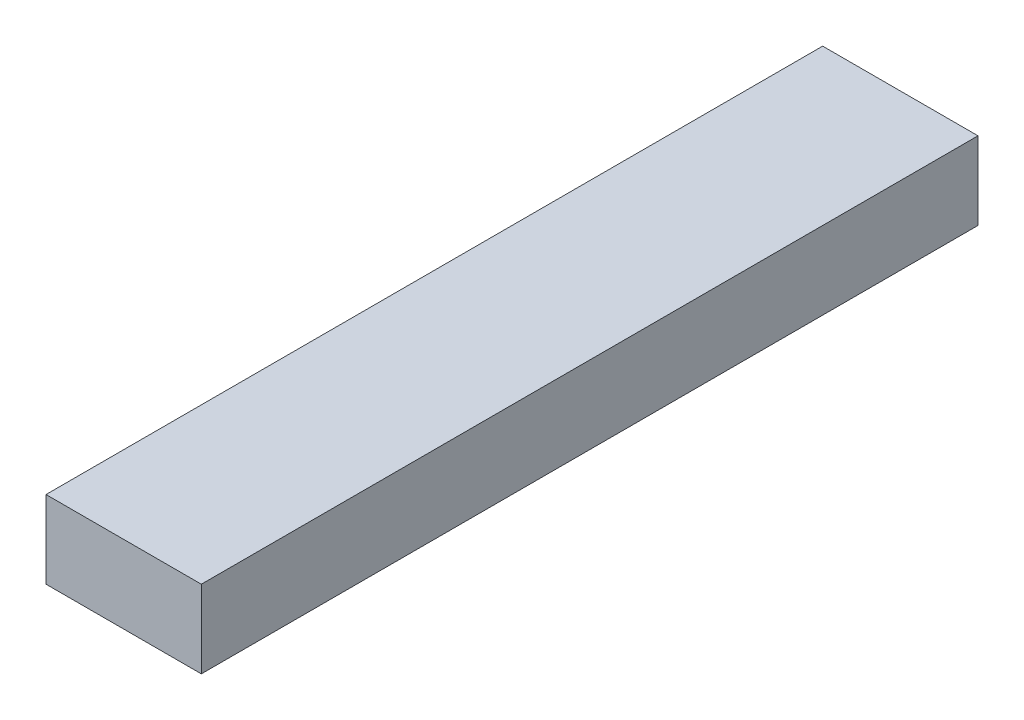
ISO-10303-21;
HEADER;
FILE_DESCRIPTION(('STEP AP214'),'2;1');
FILE_NAME('part.step','',(''),(''),'','','');
FILE_SCHEMA(('AUTOMOTIVE_DESIGN { 1 0 10303 214 1 1 1 1 }'));
ENDSEC;
DATA;
#1=APPLICATION_CONTEXT('core data for automotive mechanical design processes');
#2=APPLICATION_PROTOCOL_DEFINITION('international standard','automotive_design',2000,#1);
#3=PRODUCT_CONTEXT('',#1,'mechanical');
#4=PRODUCT('Part','Part','',(#3));
#5=PRODUCT_RELATED_PRODUCT_CATEGORY('part','',(#4));
#6=PRODUCT_DEFINITION_FORMATION('','',#4);
#7=PRODUCT_DEFINITION_CONTEXT('part definition',#1,'design');
#8=PRODUCT_DEFINITION('design','',#6,#7);
#9=PRODUCT_DEFINITION_SHAPE('','',#8);
#10=(LENGTH_UNIT() NAMED_UNIT(*) SI_UNIT(.MILLI.,.METRE.));
#11=(NAMED_UNIT(*) PLANE_ANGLE_UNIT() SI_UNIT($,.RADIAN.));
#12=(NAMED_UNIT(*) SI_UNIT($,.STERADIAN.) SOLID_ANGLE_UNIT());
#13=UNCERTAINTY_MEASURE_WITH_UNIT(LENGTH_MEASURE(1.E-05),#10,'distance_accuracy_value','');
#14=(GEOMETRIC_REPRESENTATION_CONTEXT(3) GLOBAL_UNCERTAINTY_ASSIGNED_CONTEXT((#13)) GLOBAL_UNIT_ASSIGNED_CONTEXT((#10,
#11,#12)) REPRESENTATION_CONTEXT('',''));
#15=CARTESIAN_POINT('',(0.,0.,0.));
#16=DIRECTION('',(0.,0.,1.));
#17=DIRECTION('',(1.,0.,0.));
#18=AXIS2_PLACEMENT_3D('',#15,#16,#17);
#19=CARTESIAN_POINT('',(-9.99999999999998,10.,-50.));
#20=DIRECTION('',(1.,0.,0.));
#21=DIRECTION('',(0.,0.,-1.));
#22=AXIS2_PLACEMENT_3D('',#19,#20,#21);
#23=PLANE('',#22);
#24=DIRECTION('',(0.,0.,1.));
#25=VECTOR('',#24,1.);
#26=CARTESIAN_POINT('',(-9.99999999999998,0.,-50.));
#27=LINE('',#26,#25);
#28=CARTESIAN_POINT('',(-9.99999999999998,0.,-50.));
#29=VERTEX_POINT('',#28);
#30=CARTESIAN_POINT('',(-9.99999999999995,0.,50.));
#31=VERTEX_POINT('',#30);
#32=EDGE_CURVE('E96',#29,#31,#27,.T.);
#33=ORIENTED_EDGE('',*,*,#32,.T.);
#34=DIRECTION('',(0.,-1.,0.));
#35=VECTOR('',#34,1.);
#36=CARTESIAN_POINT('',(-9.99999999999995,10.,50.));
#37=LINE('',#36,#35);
#38=CARTESIAN_POINT('',(-9.99999999999995,10.,50.));
#39=VERTEX_POINT('',#38);
#40=EDGE_CURVE('E11',#39,#31,#37,.T.);
#41=ORIENTED_EDGE('',*,*,#40,.F.);
#42=DIRECTION('',(0.,0.,1.));
#43=VECTOR('',#42,1.);
#44=CARTESIAN_POINT('',(-9.99999999999998,10.,-50.));
#45=LINE('',#44,#43);
#46=CARTESIAN_POINT('',(-9.99999999999998,10.,-50.));
#47=VERTEX_POINT('',#46);
#48=EDGE_CURVE('E84',#47,#39,#45,.T.);
#49=ORIENTED_EDGE('',*,*,#48,.F.);
#50=DIRECTION('',(0.,-1.,0.));
#51=VECTOR('',#50,1.);
#52=CARTESIAN_POINT('',(-9.99999999999998,10.,-50.));
#53=LINE('',#52,#51);
#54=EDGE_CURVE('E92',#47,#29,#53,.T.);
#55=ORIENTED_EDGE('',*,*,#54,.T.);
#56=EDGE_LOOP('',(#33,#41,#49,#55));
#57=FACE_BOUND('',#56,.T.);
#58=ADVANCED_FACE('F33',(#57),#23,.F.);
#59=CARTESIAN_POINT('',(-9.99999999999995,10.,50.));
#60=DIRECTION('',(0.,0.,-1.));
#61=DIRECTION('',(-1.,0.,0.));
#62=AXIS2_PLACEMENT_3D('',#59,#60,#61);
#63=PLANE('',#62);
#64=DIRECTION('',(1.,0.,0.));
#65=VECTOR('',#64,1.);
#66=CARTESIAN_POINT('',(-9.99999999999995,0.,50.));
#67=LINE('',#66,#65);
#68=CARTESIAN_POINT('',(10.,0.,50.));
#69=VERTEX_POINT('',#68);
#70=EDGE_CURVE('E88',#31,#69,#67,.T.);
#71=ORIENTED_EDGE('',*,*,#70,.T.);
#72=DIRECTION('',(0.,-1.,0.));
#73=VECTOR('',#72,1.);
#74=CARTESIAN_POINT('',(10.,10.,50.));
#75=LINE('',#74,#73);
#76=CARTESIAN_POINT('',(10.,10.,50.));
#77=VERTEX_POINT('',#76);
#78=EDGE_CURVE('E41',#77,#69,#75,.T.);
#79=ORIENTED_EDGE('',*,*,#78,.F.);
#80=DIRECTION('',(1.,0.,0.));
#81=VECTOR('',#80,1.);
#82=CARTESIAN_POINT('',(-9.99999999999995,10.,50.));
#83=LINE('',#82,#81);
#84=EDGE_CURVE('E79',#39,#77,#83,.T.);
#85=ORIENTED_EDGE('',*,*,#84,.F.);
#86=ORIENTED_EDGE('',*,*,#40,.T.);
#87=EDGE_LOOP('',(#71,#79,#85,#86));
#88=FACE_BOUND('',#87,.T.);
#89=ADVANCED_FACE('F87',(#88),#63,.F.);
#90=CARTESIAN_POINT('',(9.99999999999998,10.,-50.));
#91=DIRECTION('',(-1.,0.,0.));
#92=DIRECTION('',(0.,0.,1.));
#93=AXIS2_PLACEMENT_3D('',#90,#91,#92);
#94=PLANE('',#93);
#95=DIRECTION('',(0.,0.,-1.));
#96=VECTOR('',#95,1.);
#97=CARTESIAN_POINT('',(9.99999999999998,0.,-50.));
#98=LINE('',#97,#96);
#99=CARTESIAN_POINT('',(9.99999999999998,0.,-50.));
#100=VERTEX_POINT('',#99);
#101=EDGE_CURVE('E66',#69,#100,#98,.T.);
#102=ORIENTED_EDGE('',*,*,#101,.T.);
#103=DIRECTION('',(0.,-1.,0.));
#104=VECTOR('',#103,1.);
#105=CARTESIAN_POINT('',(9.99999999999998,10.,-50.));
#106=LINE('',#105,#104);
#107=CARTESIAN_POINT('',(9.99999999999998,10.,-50.));
#108=VERTEX_POINT('',#107);
#109=EDGE_CURVE('E89',#108,#100,#106,.T.);
#110=ORIENTED_EDGE('',*,*,#109,.F.);
#111=DIRECTION('',(0.,0.,-1.));
#112=VECTOR('',#111,1.);
#113=CARTESIAN_POINT('',(9.99999999999998,10.,-50.));
#114=LINE('',#113,#112);
#115=EDGE_CURVE('E82',#77,#108,#114,.T.);
#116=ORIENTED_EDGE('',*,*,#115,.F.);
#117=ORIENTED_EDGE('',*,*,#78,.T.);
#118=EDGE_LOOP('',(#102,#110,#116,#117));
#119=FACE_BOUND('',#118,.T.);
#120=ADVANCED_FACE('F90',(#119),#94,.F.);
#121=CARTESIAN_POINT('',(-9.99999999999998,10.,-50.));
#122=DIRECTION('',(0.,0.,1.));
#123=DIRECTION('',(1.,0.,0.));
#124=AXIS2_PLACEMENT_3D('',#121,#122,#123);
#125=PLANE('',#124);
#126=DIRECTION('',(-1.,0.,0.));
#127=VECTOR('',#126,1.);
#128=CARTESIAN_POINT('',(-9.99999999999998,0.,-50.));
#129=LINE('',#128,#127);
#130=EDGE_CURVE('E72',#100,#29,#129,.T.);
#131=ORIENTED_EDGE('',*,*,#130,.T.);
#132=ORIENTED_EDGE('',*,*,#54,.F.);
#133=DIRECTION('',(-1.,0.,0.));
#134=VECTOR('',#133,1.);
#135=CARTESIAN_POINT('',(-9.99999999999998,10.,-50.));
#136=LINE('',#135,#134);
#137=EDGE_CURVE('E49',#108,#47,#136,.T.);
#138=ORIENTED_EDGE('',*,*,#137,.F.);
#139=ORIENTED_EDGE('',*,*,#109,.T.);
#140=EDGE_LOOP('',(#131,#132,#138,#139));
#141=FACE_BOUND('',#140,.T.);
#142=ADVANCED_FACE('F103',(#141),#125,.F.);
#143=CARTESIAN_POINT('',(0.,10.,0.));
#144=DIRECTION('',(0.,1.,0.));
#145=DIRECTION('',(0.,0.,1.));
#146=AXIS2_PLACEMENT_3D('',#143,#144,#145);
#147=PLANE('',#146);
#148=ORIENTED_EDGE('',*,*,#48,.T.);
#149=ORIENTED_EDGE('',*,*,#84,.T.);
#150=ORIENTED_EDGE('',*,*,#115,.T.);
#151=ORIENTED_EDGE('',*,*,#137,.T.);
#152=EDGE_LOOP('',(#148,#149,#150,#151));
#153=FACE_BOUND('',#152,.T.);
#154=ADVANCED_FACE('F80',(#153),#147,.T.);
#155=CARTESIAN_POINT('',(0.,0.,0.));
#156=DIRECTION('',(0.,1.,0.));
#157=DIRECTION('',(0.,0.,1.));
#158=AXIS2_PLACEMENT_3D('',#155,#156,#157);
#159=PLANE('',#158);
#160=ORIENTED_EDGE('',*,*,#32,.F.);
#161=ORIENTED_EDGE('',*,*,#130,.F.);
#162=ORIENTED_EDGE('',*,*,#101,.F.);
#163=ORIENTED_EDGE('',*,*,#70,.F.);
#164=EDGE_LOOP('',(#160,#161,#162,#163));
#165=FACE_BOUND('',#164,.T.);
#166=ADVANCED_FACE('F106',(#165),#159,.F.);
#167=CLOSED_SHELL('',(#58,#89,#120,#142,#154,#166));
#168=MANIFOLD_SOLID_BREP('B2',#167);
#169=ADVANCED_BREP_SHAPE_REPRESENTATION('',(#18,#168),#14);
#170=SHAPE_DEFINITION_REPRESENTATION(#9,#169);
ENDSEC;
END-ISO-10303-21;
